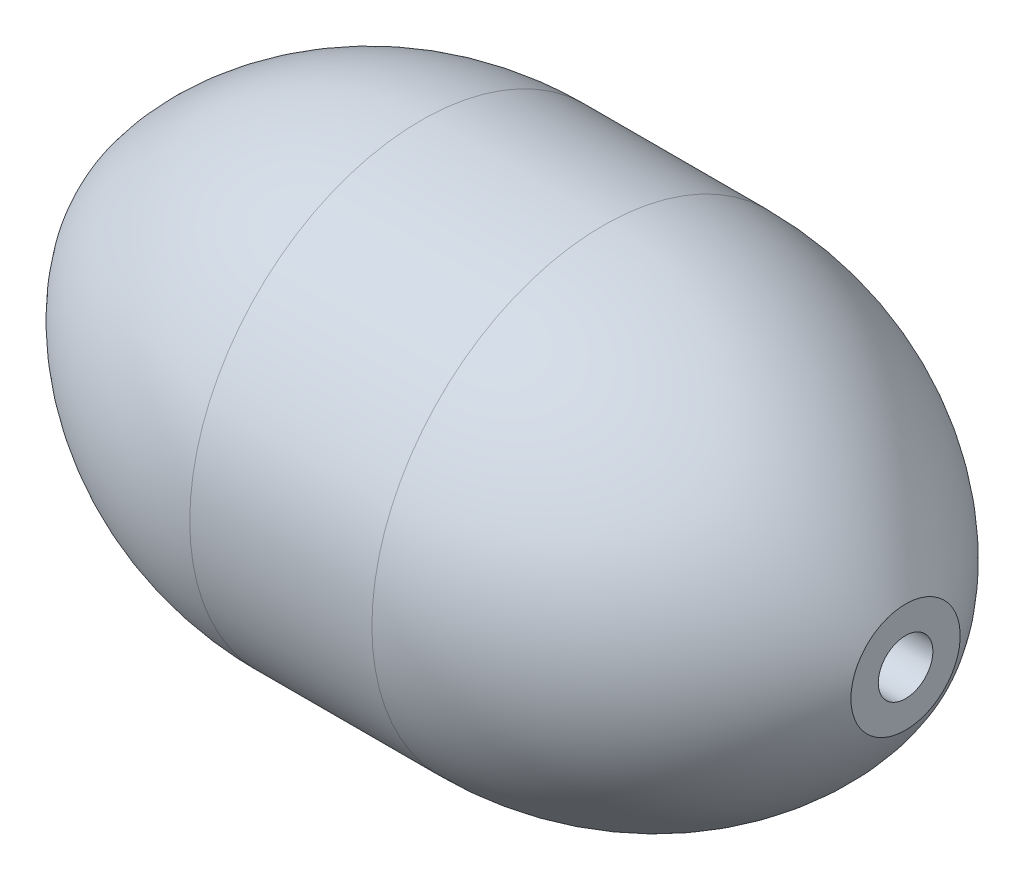
ISO-10303-21;
HEADER;
FILE_DESCRIPTION(('STEP AP214'),'2;1');
FILE_NAME('part.step','',(''),(''),'','','');
FILE_SCHEMA(('AUTOMOTIVE_DESIGN { 1 0 10303 214 1 1 1 1 }'));
ENDSEC;
DATA;
#1=APPLICATION_CONTEXT('core data for automotive mechanical design processes');
#2=APPLICATION_PROTOCOL_DEFINITION('international standard','automotive_design',2000,#1);
#3=PRODUCT_CONTEXT('',#1,'mechanical');
#4=PRODUCT('Part','Part','',(#3));
#5=PRODUCT_RELATED_PRODUCT_CATEGORY('part','',(#4));
#6=PRODUCT_DEFINITION_FORMATION('','',#4);
#7=PRODUCT_DEFINITION_CONTEXT('part definition',#1,'design');
#8=PRODUCT_DEFINITION('design','',#6,#7);
#9=PRODUCT_DEFINITION_SHAPE('','',#8);
#10=(LENGTH_UNIT() NAMED_UNIT(*) SI_UNIT(.MILLI.,.METRE.));
#11=(NAMED_UNIT(*) PLANE_ANGLE_UNIT() SI_UNIT($,.RADIAN.));
#12=(NAMED_UNIT(*) SI_UNIT($,.STERADIAN.) SOLID_ANGLE_UNIT());
#13=UNCERTAINTY_MEASURE_WITH_UNIT(LENGTH_MEASURE(1.E-05),#10,'distance_accuracy_value','');
#14=(GEOMETRIC_REPRESENTATION_CONTEXT(3) GLOBAL_UNCERTAINTY_ASSIGNED_CONTEXT((#13)) GLOBAL_UNIT_ASSIGNED_CONTEXT((#10,
#11,#12)) REPRESENTATION_CONTEXT('',''));
#15=CARTESIAN_POINT('',(0.,0.,0.));
#16=DIRECTION('',(0.,0.,1.));
#17=DIRECTION('',(1.,0.,0.));
#18=AXIS2_PLACEMENT_3D('',#15,#16,#17);
#19=CARTESIAN_POINT('',(-2.16,0.,0.));
#20=DIRECTION('',(-1.,0.,0.));
#21=DIRECTION('',(0.,0.,1.));
#22=AXIS2_PLACEMENT_3D('',#19,#20,#21);
#23=CYLINDRICAL_SURFACE('',#22,0.15);
#24=CARTESIAN_POINT('',(2.16,0.,0.));
#25=DIRECTION('',(-1.,0.,0.));
#26=DIRECTION('',(0.,0.,1.));
#27=AXIS2_PLACEMENT_3D('',#24,#25,#26);
#28=CIRCLE('',#27,0.15);
#29=CARTESIAN_POINT('',(2.16,0.,0.15));
#30=VERTEX_POINT('',#29);
#31=EDGE_CURVE('E54',#30,#30,#28,.T.);
#32=ORIENTED_EDGE('',*,*,#31,.F.);
#33=EDGE_LOOP('',(#32));
#34=FACE_BOUND('',#33,.T.);
#35=CARTESIAN_POINT('',(-2.16,0.,0.));
#36=DIRECTION('',(-1.,0.,0.));
#37=DIRECTION('',(0.,0.,1.));
#38=AXIS2_PLACEMENT_3D('',#35,#36,#37);
#39=CIRCLE('',#38,0.15);
#40=CARTESIAN_POINT('',(-2.16,0.,0.15));
#41=VERTEX_POINT('',#40);
#42=EDGE_CURVE('E10',#41,#41,#39,.T.);
#43=ORIENTED_EDGE('',*,*,#42,.T.);
#44=EDGE_LOOP('',(#43));
#45=FACE_BOUND('',#44,.T.);
#46=ADVANCED_FACE('F32',(#34,#45),#23,.F.);
#47=CARTESIAN_POINT('',(-2.16,0.15,0.));
#48=DIRECTION('',(1.,0.,0.));
#49=DIRECTION('',(0.,0.,-1.));
#50=AXIS2_PLACEMENT_3D('',#47,#48,#49);
#51=PLANE('',#50);
#52=ORIENTED_EDGE('',*,*,#42,.F.);
#53=EDGE_LOOP('',(#52));
#54=FACE_BOUND('',#53,.T.);
#55=CARTESIAN_POINT('',(-2.16,0.,0.));
#56=DIRECTION('',(-1.,0.,0.));
#57=DIRECTION('',(0.,0.,1.));
#58=AXIS2_PLACEMENT_3D('',#55,#56,#57);
#59=CIRCLE('',#58,0.3);
#60=CARTESIAN_POINT('',(-2.16,0.,0.3));
#61=VERTEX_POINT('',#60);
#62=EDGE_CURVE('E38',#61,#61,#59,.T.);
#63=ORIENTED_EDGE('',*,*,#62,.T.);
#64=EDGE_LOOP('',(#63));
#65=FACE_BOUND('',#64,.T.);
#66=ADVANCED_FACE('F61',(#54,#65),#51,.F.);
#67=CARTESIAN_POINT('',(-0.5,0.,0.));
#68=DIRECTION('',(-1.,0.,0.));
#69=DIRECTION('',(0.,0.,1.));
#70=AXIS2_PLACEMENT_3D('',#67,#68,#69);
#71=DEGENERATE_TOROIDAL_SURFACE('',#70,0.63541237113402,1.90541237113402,.F.);
#72=ORIENTED_EDGE('',*,*,#62,.F.);
#73=EDGE_LOOP('',(#72));
#74=FACE_BOUND('',#73,.T.);
#75=CARTESIAN_POINT('',(-0.5,0.,0.));
#76=DIRECTION('',(-1.,0.,0.));
#77=DIRECTION('',(0.,0.,1.));
#78=AXIS2_PLACEMENT_3D('',#75,#76,#77);
#79=CIRCLE('',#78,1.27);
#80=CARTESIAN_POINT('',(-0.5,0.,1.27));
#81=VERTEX_POINT('',#80);
#82=EDGE_CURVE('E42',#81,#81,#79,.T.);
#83=ORIENTED_EDGE('',*,*,#82,.T.);
#84=EDGE_LOOP('',(#83));
#85=FACE_BOUND('',#84,.T.);
#86=ADVANCED_FACE('F65',(#74,#85),#71,.F.);
#87=CARTESIAN_POINT('',(-2.16,0.,0.));
#88=DIRECTION('',(-1.,0.,0.));
#89=DIRECTION('',(0.,0.,1.));
#90=AXIS2_PLACEMENT_3D('',#87,#88,#89);
#91=CYLINDRICAL_SURFACE('',#90,1.27);
#92=ORIENTED_EDGE('',*,*,#82,.F.);
#93=EDGE_LOOP('',(#92));
#94=FACE_BOUND('',#93,.T.);
#95=CARTESIAN_POINT('',(0.5,0.,0.));
#96=DIRECTION('',(-1.,0.,0.));
#97=DIRECTION('',(0.,0.,1.));
#98=AXIS2_PLACEMENT_3D('',#95,#96,#97);
#99=CIRCLE('',#98,1.27);
#100=CARTESIAN_POINT('',(0.5,0.,1.27));
#101=VERTEX_POINT('',#100);
#102=EDGE_CURVE('E46',#101,#101,#99,.T.);
#103=ORIENTED_EDGE('',*,*,#102,.T.);
#104=EDGE_LOOP('',(#103));
#105=FACE_BOUND('',#104,.T.);
#106=ADVANCED_FACE('F70',(#94,#105),#91,.T.);
#107=CARTESIAN_POINT('',(0.5,0.,0.));
#108=DIRECTION('',(-1.,0.,0.));
#109=DIRECTION('',(0.,0.,1.));
#110=AXIS2_PLACEMENT_3D('',#107,#108,#109);
#111=DEGENERATE_TOROIDAL_SURFACE('',#110,0.63541237113402,1.90541237113402,.F.);
#112=ORIENTED_EDGE('',*,*,#102,.F.);
#113=EDGE_LOOP('',(#112));
#114=FACE_BOUND('',#113,.T.);
#115=CARTESIAN_POINT('',(2.16,0.,0.));
#116=DIRECTION('',(-1.,0.,0.));
#117=DIRECTION('',(0.,0.,1.));
#118=AXIS2_PLACEMENT_3D('',#115,#116,#117);
#119=CIRCLE('',#118,0.3);
#120=CARTESIAN_POINT('',(2.16,0.,0.3));
#121=VERTEX_POINT('',#120);
#122=EDGE_CURVE('E51',#121,#121,#119,.T.);
#123=ORIENTED_EDGE('',*,*,#122,.T.);
#124=EDGE_LOOP('',(#123));
#125=FACE_BOUND('',#124,.T.);
#126=ADVANCED_FACE('F76',(#114,#125),#111,.F.);
#127=CARTESIAN_POINT('',(2.16,0.3,0.));
#128=DIRECTION('',(-1.,0.,0.));
#129=DIRECTION('',(0.,0.,1.));
#130=AXIS2_PLACEMENT_3D('',#127,#128,#129);
#131=PLANE('',#130);
#132=ORIENTED_EDGE('',*,*,#122,.F.);
#133=EDGE_LOOP('',(#132));
#134=FACE_BOUND('',#133,.T.);
#135=ORIENTED_EDGE('',*,*,#31,.T.);
#136=EDGE_LOOP('',(#135));
#137=FACE_BOUND('',#136,.T.);
#138=ADVANCED_FACE('F58',(#134,#137),#131,.F.);
#139=CLOSED_SHELL('',(#46,#66,#86,#106,#126,#138));
#140=MANIFOLD_SOLID_BREP('B2',#139);
#141=ADVANCED_BREP_SHAPE_REPRESENTATION('',(#18,#140),#14);
#142=SHAPE_DEFINITION_REPRESENTATION(#9,#141);
ENDSEC;
END-ISO-10303-21;
